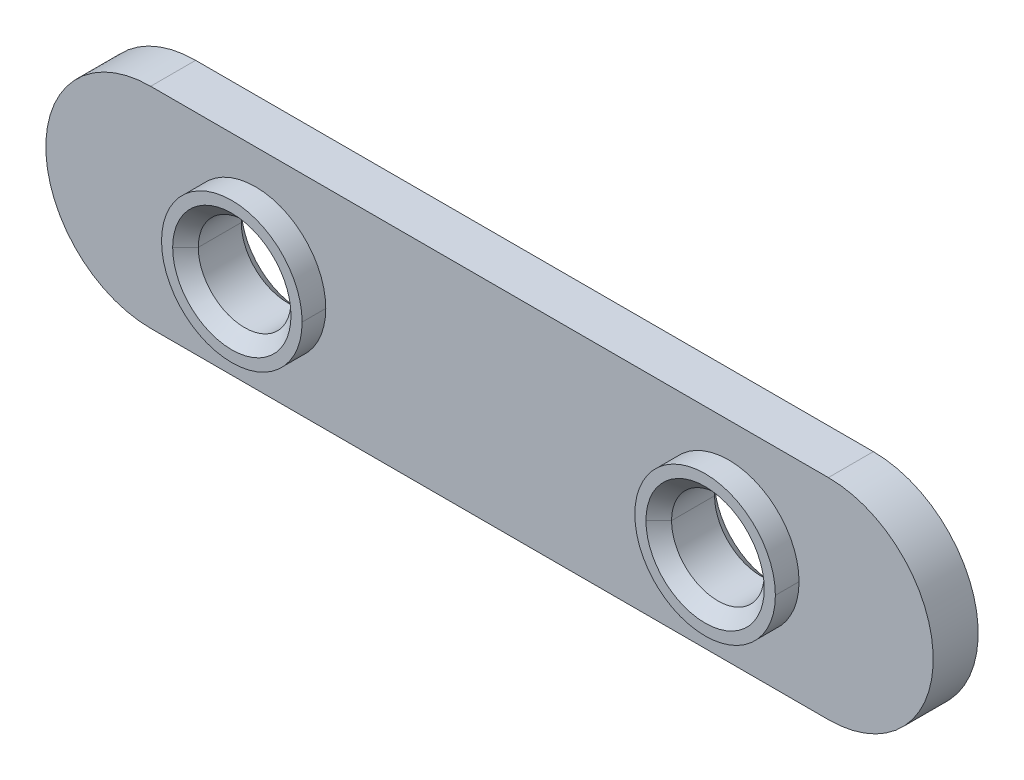
ISO-10303-21;
HEADER;
FILE_DESCRIPTION(('STEP AP214'),'2;1');
FILE_NAME('part.step','',(''),(''),'','','');
FILE_SCHEMA(('AUTOMOTIVE_DESIGN { 1 0 10303 214 1 1 1 1 }'));
ENDSEC;
DATA;
#1=APPLICATION_CONTEXT('core data for automotive mechanical design processes');
#2=APPLICATION_PROTOCOL_DEFINITION('international standard','automotive_design',2000,#1);
#3=PRODUCT_CONTEXT('',#1,'mechanical');
#4=PRODUCT('Part','Part','',(#3));
#5=PRODUCT_RELATED_PRODUCT_CATEGORY('part','',(#4));
#6=PRODUCT_DEFINITION_FORMATION('','',#4);
#7=PRODUCT_DEFINITION_CONTEXT('part definition',#1,'design');
#8=PRODUCT_DEFINITION('design','',#6,#7);
#9=PRODUCT_DEFINITION_SHAPE('','',#8);
#10=(LENGTH_UNIT() NAMED_UNIT(*) SI_UNIT(.MILLI.,.METRE.));
#11=(NAMED_UNIT(*) PLANE_ANGLE_UNIT() SI_UNIT($,.RADIAN.));
#12=(NAMED_UNIT(*) SI_UNIT($,.STERADIAN.) SOLID_ANGLE_UNIT());
#13=UNCERTAINTY_MEASURE_WITH_UNIT(LENGTH_MEASURE(1.E-05),#10,'distance_accuracy_value','');
#14=(GEOMETRIC_REPRESENTATION_CONTEXT(3) GLOBAL_UNCERTAINTY_ASSIGNED_CONTEXT((#13)) GLOBAL_UNIT_ASSIGNED_CONTEXT((#10,
#11,#12)) REPRESENTATION_CONTEXT('',''));
#15=CARTESIAN_POINT('',(0.,0.,0.));
#16=DIRECTION('',(0.,0.,1.));
#17=DIRECTION('',(1.,0.,0.));
#18=AXIS2_PLACEMENT_3D('',#15,#16,#17);
#19=CARTESIAN_POINT('',(29.1719,0.,2.4765));
#20=DIRECTION('',(0.,0.,-1.));
#21=DIRECTION('',(-1.,0.,0.));
#22=AXIS2_PLACEMENT_3D('',#19,#20,#21);
#23=PLANE('',#22);
#24=CARTESIAN_POINT('',(25.4,0.,2.4765));
#25=DIRECTION('',(0.,0.,1.));
#26=DIRECTION('',(1.,0.,0.));
#27=AXIS2_PLACEMENT_3D('',#24,#25,#26);
#28=CIRCLE('',#27,3.175);
#29=CARTESIAN_POINT('',(28.575,0.,2.4765));
#30=VERTEX_POINT('',#29);
#31=CARTESIAN_POINT('',(22.2249999999982,0.,2.47649999999825));
#32=VERTEX_POINT('',#31);
#33=EDGE_CURVE('E11',#30,#32,#28,.T.);
#34=ORIENTED_EDGE('',*,*,#33,.F.);
#35=CARTESIAN_POINT('',(25.4,0.,2.4765));
#36=DIRECTION('',(0.,0.,1.));
#37=DIRECTION('',(1.,0.,0.));
#38=AXIS2_PLACEMENT_3D('',#35,#36,#37);
#39=CIRCLE('',#38,3.175);
#40=EDGE_CURVE('E25',#32,#30,#39,.T.);
#41=ORIENTED_EDGE('',*,*,#40,.F.);
#42=EDGE_LOOP('',(#34,#41));
#43=FACE_BOUND('',#42,.T.);
#44=CARTESIAN_POINT('',(25.4,0.,2.4765));
#45=DIRECTION('',(0.,0.,1.));
#46=DIRECTION('',(1.,0.,0.));
#47=AXIS2_PLACEMENT_3D('',#44,#45,#46);
#48=CIRCLE('',#47,3.7719);
#49=CARTESIAN_POINT('',(29.1719,0.,2.4765));
#50=VERTEX_POINT('',#49);
#51=CARTESIAN_POINT('',(21.6281,0.,2.4765));
#52=VERTEX_POINT('',#51);
#53=EDGE_CURVE('E348',#50,#52,#48,.T.);
#54=ORIENTED_EDGE('',*,*,#53,.T.);
#55=CARTESIAN_POINT('',(25.4,0.,2.4765));
#56=DIRECTION('',(0.,0.,1.));
#57=DIRECTION('',(1.,0.,0.));
#58=AXIS2_PLACEMENT_3D('',#55,#56,#57);
#59=CIRCLE('',#58,3.7719);
#60=EDGE_CURVE('E344',#52,#50,#59,.T.);
#61=ORIENTED_EDGE('',*,*,#60,.T.);
#62=EDGE_LOOP('',(#54,#61));
#63=FACE_BOUND('',#62,.T.);
#64=ADVANCED_FACE('F17',(#43,#63),#23,.F.);
#65=CARTESIAN_POINT('',(25.4,0.,2.4765));
#66=DIRECTION('',(0.,0.,-1.));
#67=DIRECTION('',(0.,1.,0.));
#68=AXIS2_PLACEMENT_3D('',#65,#66,#67);
#69=CYLINDRICAL_SURFACE('',#68,3.7719);
#70=CARTESIAN_POINT('',(25.4,0.,1.2065));
#71=DIRECTION('',(0.,0.,1.));
#72=DIRECTION('',(1.,0.,0.));
#73=AXIS2_PLACEMENT_3D('',#70,#71,#72);
#74=CIRCLE('',#73,3.7719);
#75=CARTESIAN_POINT('',(21.6281,0.,1.2065));
#76=VERTEX_POINT('',#75);
#77=CARTESIAN_POINT('',(29.1719,0.,1.2065));
#78=VERTEX_POINT('',#77);
#79=EDGE_CURVE('E340',#76,#78,#74,.T.);
#80=ORIENTED_EDGE('',*,*,#79,.T.);
#81=DIRECTION('',(0.,0.,-1.));
#82=VECTOR('',#81,1.);
#83=CARTESIAN_POINT('',(29.1719,0.,2.4765));
#84=LINE('',#83,#82);
#85=EDGE_CURVE('E335',#50,#78,#84,.T.);
#86=ORIENTED_EDGE('',*,*,#85,.F.);
#87=ORIENTED_EDGE('',*,*,#60,.F.);
#88=DIRECTION('',(0.,0.,-1.));
#89=VECTOR('',#88,1.);
#90=CARTESIAN_POINT('',(21.6281,0.,2.4765));
#91=LINE('',#90,#89);
#92=EDGE_CURVE('E331',#52,#76,#91,.T.);
#93=ORIENTED_EDGE('',*,*,#92,.T.);
#94=EDGE_LOOP('',(#80,#86,#87,#93));
#95=FACE_BOUND('',#94,.T.);
#96=ADVANCED_FACE('F363',(#95),#69,.T.);
#97=CARTESIAN_POINT('',(25.4,0.,2.4765));
#98=DIRECTION('',(0.,0.,-1.));
#99=DIRECTION('',(0.,-1.,0.));
#100=AXIS2_PLACEMENT_3D('',#97,#98,#99);
#101=CYLINDRICAL_SURFACE('',#100,3.7719);
#102=ORIENTED_EDGE('',*,*,#53,.F.);
#103=ORIENTED_EDGE('',*,*,#85,.T.);
#104=CARTESIAN_POINT('',(25.4,0.,1.2065));
#105=DIRECTION('',(0.,0.,1.));
#106=DIRECTION('',(1.,0.,0.));
#107=AXIS2_PLACEMENT_3D('',#104,#105,#106);
#108=CIRCLE('',#107,3.7719);
#109=EDGE_CURVE('E326',#78,#76,#108,.T.);
#110=ORIENTED_EDGE('',*,*,#109,.T.);
#111=ORIENTED_EDGE('',*,*,#92,.F.);
#112=EDGE_LOOP('',(#102,#103,#110,#111));
#113=FACE_BOUND('',#112,.T.);
#114=ADVANCED_FACE('F364',(#113),#101,.T.);
#115=CARTESIAN_POINT('',(-5.6261,0.,1.2065));
#116=DIRECTION('',(0.,0.,1.));
#117=DIRECTION('',(1.,0.,0.));
#118=AXIS2_PLACEMENT_3D('',#115,#116,#117);
#119=PLANE('',#118);
#120=ORIENTED_EDGE('',*,*,#109,.F.);
#121=ORIENTED_EDGE('',*,*,#79,.F.);
#122=EDGE_LOOP('',(#120,#121));
#123=FACE_BOUND('',#122,.T.);
#124=CARTESIAN_POINT('',(0.,0.,1.2065));
#125=DIRECTION('',(0.,0.,1.));
#126=DIRECTION('',(1.,0.,0.));
#127=AXIS2_PLACEMENT_3D('',#124,#125,#126);
#128=CIRCLE('',#127,3.7719);
#129=CARTESIAN_POINT('',(3.7719,0.,1.2065));
#130=VERTEX_POINT('',#129);
#131=CARTESIAN_POINT('',(-3.7719,0.,1.2065));
#132=VERTEX_POINT('',#131);
#133=EDGE_CURVE('E321',#130,#132,#128,.T.);
#134=ORIENTED_EDGE('',*,*,#133,.F.);
#135=CARTESIAN_POINT('',(0.,0.,1.2065));
#136=DIRECTION('',(0.,0.,1.));
#137=DIRECTION('',(1.,0.,0.));
#138=AXIS2_PLACEMENT_3D('',#135,#136,#137);
#139=CIRCLE('',#138,3.7719);
#140=EDGE_CURVE('E316',#132,#130,#139,.T.);
#141=ORIENTED_EDGE('',*,*,#140,.F.);
#142=EDGE_LOOP('',(#134,#141));
#143=FACE_BOUND('',#142,.T.);
#144=DIRECTION('',(-1.,0.,0.));
#145=VECTOR('',#144,1.);
#146=CARTESIAN_POINT('',(30.7467,5.6261,1.2065));
#147=LINE('',#146,#145);
#148=CARTESIAN_POINT('',(30.7467,5.6261,1.2065));
#149=VERTEX_POINT('',#148);
#150=CARTESIAN_POINT('',(-5.6261,5.6261,1.2065));
#151=VERTEX_POINT('',#150);
#152=EDGE_CURVE('E312',#149,#151,#147,.T.);
#153=ORIENTED_EDGE('',*,*,#152,.T.);
#154=CARTESIAN_POINT('',(-5.6261,0.,1.2065));
#155=DIRECTION('',(0.,0.,1.));
#156=DIRECTION('',(1.,0.,0.));
#157=AXIS2_PLACEMENT_3D('',#154,#155,#156);
#158=CIRCLE('',#157,5.6261);
#159=CARTESIAN_POINT('',(-5.6261,-5.6261,1.2065));
#160=VERTEX_POINT('',#159);
#161=EDGE_CURVE('E308',#151,#160,#158,.T.);
#162=ORIENTED_EDGE('',*,*,#161,.T.);
#163=DIRECTION('',(1.,0.,0.));
#164=VECTOR('',#163,1.);
#165=CARTESIAN_POINT('',(-5.6261,-5.6261,1.2065));
#166=LINE('',#165,#164);
#167=CARTESIAN_POINT('',(30.7467,-5.6261,1.2065));
#168=VERTEX_POINT('',#167);
#169=EDGE_CURVE('E304',#160,#168,#166,.T.);
#170=ORIENTED_EDGE('',*,*,#169,.T.);
#171=CARTESIAN_POINT('',(30.7467,0.,1.2065));
#172=DIRECTION('',(0.,0.,1.));
#173=DIRECTION('',(1.,0.,0.));
#174=AXIS2_PLACEMENT_3D('',#171,#172,#173);
#175=CIRCLE('',#174,5.6261);
#176=EDGE_CURVE('E300',#168,#149,#175,.T.);
#177=ORIENTED_EDGE('',*,*,#176,.T.);
#178=EDGE_LOOP('',(#153,#162,#170,#177));
#179=FACE_BOUND('',#178,.T.);
#180=ADVANCED_FACE('F368',(#123,#143,#179),#119,.T.);
#181=CARTESIAN_POINT('',(30.7467,0.,1.2065));
#182=DIRECTION('',(0.,0.,1.));
#183=DIRECTION('',(-1.,0.,0.));
#184=AXIS2_PLACEMENT_3D('',#181,#182,#183);
#185=CYLINDRICAL_SURFACE('',#184,5.6261);
#186=CARTESIAN_POINT('',(30.7467,0.,-1.2065));
#187=DIRECTION('',(0.,0.,1.));
#188=DIRECTION('',(1.,0.,0.));
#189=AXIS2_PLACEMENT_3D('',#186,#187,#188);
#190=CIRCLE('',#189,5.6261);
#191=CARTESIAN_POINT('',(30.7467,-5.6261,-1.2065));
#192=VERTEX_POINT('',#191);
#193=CARTESIAN_POINT('',(30.7467,5.6261,-1.2065));
#194=VERTEX_POINT('',#193);
#195=EDGE_CURVE('E296',#192,#194,#190,.T.);
#196=ORIENTED_EDGE('',*,*,#195,.T.);
#197=DIRECTION('',(0.,0.,-1.));
#198=VECTOR('',#197,1.);
#199=CARTESIAN_POINT('',(30.7467,5.6261,1.2065));
#200=LINE('',#199,#198);
#201=EDGE_CURVE('E291',#149,#194,#200,.T.);
#202=ORIENTED_EDGE('',*,*,#201,.F.);
#203=ORIENTED_EDGE('',*,*,#176,.F.);
#204=DIRECTION('',(0.,0.,-1.));
#205=VECTOR('',#204,1.);
#206=CARTESIAN_POINT('',(30.7467,-5.6261,1.2065));
#207=LINE('',#206,#205);
#208=EDGE_CURVE('E287',#168,#192,#207,.T.);
#209=ORIENTED_EDGE('',*,*,#208,.T.);
#210=EDGE_LOOP('',(#196,#202,#203,#209));
#211=FACE_BOUND('',#210,.T.);
#212=ADVANCED_FACE('F371',(#211),#185,.T.);
#213=CARTESIAN_POINT('',(-5.6261,-5.6261,1.2065));
#214=DIRECTION('',(0.,1.,0.));
#215=DIRECTION('',(0.,0.,1.));
#216=AXIS2_PLACEMENT_3D('',#213,#214,#215);
#217=PLANE('',#216);
#218=DIRECTION('',(1.,0.,0.));
#219=VECTOR('',#218,1.);
#220=CARTESIAN_POINT('',(-5.6261,-5.6261,-1.2065));
#221=LINE('',#220,#219);
#222=CARTESIAN_POINT('',(-5.6261,-5.6261,-1.2065));
#223=VERTEX_POINT('',#222);
#224=EDGE_CURVE('E282',#223,#192,#221,.T.);
#225=ORIENTED_EDGE('',*,*,#224,.T.);
#226=ORIENTED_EDGE('',*,*,#208,.F.);
#227=ORIENTED_EDGE('',*,*,#169,.F.);
#228=DIRECTION('',(0.,0.,-1.));
#229=VECTOR('',#228,1.);
#230=CARTESIAN_POINT('',(-5.6261,-5.6261,1.2065));
#231=LINE('',#230,#229);
#232=EDGE_CURVE('E278',#160,#223,#231,.T.);
#233=ORIENTED_EDGE('',*,*,#232,.T.);
#234=EDGE_LOOP('',(#225,#226,#227,#233));
#235=FACE_BOUND('',#234,.T.);
#236=ADVANCED_FACE('F393',(#235),#217,.F.);
#237=CARTESIAN_POINT('',(-5.6261,0.,1.2065));
#238=DIRECTION('',(0.,0.,1.));
#239=DIRECTION('',(1.,0.,0.));
#240=AXIS2_PLACEMENT_3D('',#237,#238,#239);
#241=CYLINDRICAL_SURFACE('',#240,5.6261);
#242=CARTESIAN_POINT('',(-5.6261,0.,-1.2065));
#243=DIRECTION('',(0.,0.,1.));
#244=DIRECTION('',(1.,0.,0.));
#245=AXIS2_PLACEMENT_3D('',#242,#243,#244);
#246=CIRCLE('',#245,5.6261);
#247=CARTESIAN_POINT('',(-5.6261,5.6261,-1.2065));
#248=VERTEX_POINT('',#247);
#249=EDGE_CURVE('E273',#248,#223,#246,.T.);
#250=ORIENTED_EDGE('',*,*,#249,.T.);
#251=ORIENTED_EDGE('',*,*,#232,.F.);
#252=ORIENTED_EDGE('',*,*,#161,.F.);
#253=DIRECTION('',(0.,0.,-1.));
#254=VECTOR('',#253,1.);
#255=CARTESIAN_POINT('',(-5.6261,5.6261,1.2065));
#256=LINE('',#255,#254);
#257=EDGE_CURVE('E269',#151,#248,#256,.T.);
#258=ORIENTED_EDGE('',*,*,#257,.T.);
#259=EDGE_LOOP('',(#250,#251,#252,#258));
#260=FACE_BOUND('',#259,.T.);
#261=ADVANCED_FACE('F383',(#260),#241,.T.);
#262=CARTESIAN_POINT('',(30.7467,5.6261,1.2065));
#263=DIRECTION('',(0.,-1.,0.));
#264=DIRECTION('',(0.,0.,-1.));
#265=AXIS2_PLACEMENT_3D('',#262,#263,#264);
#266=PLANE('',#265);
#267=DIRECTION('',(-1.,0.,0.));
#268=VECTOR('',#267,1.);
#269=CARTESIAN_POINT('',(30.7467,5.6261,-1.2065));
#270=LINE('',#269,#268);
#271=EDGE_CURVE('E264',#194,#248,#270,.T.);
#272=ORIENTED_EDGE('',*,*,#271,.T.);
#273=ORIENTED_EDGE('',*,*,#257,.F.);
#274=ORIENTED_EDGE('',*,*,#152,.F.);
#275=ORIENTED_EDGE('',*,*,#201,.T.);
#276=EDGE_LOOP('',(#272,#273,#274,#275));
#277=FACE_BOUND('',#276,.T.);
#278=ADVANCED_FACE('F384',(#277),#266,.F.);
#279=CARTESIAN_POINT('',(-5.6261,0.,-1.2065));
#280=DIRECTION('',(0.,0.,1.));
#281=DIRECTION('',(1.,0.,0.));
#282=AXIS2_PLACEMENT_3D('',#279,#280,#281);
#283=PLANE('',#282);
#284=CARTESIAN_POINT('',(25.4,0.,-1.2065));
#285=DIRECTION('',(0.,0.,1.));
#286=DIRECTION('',(1.,0.,0.));
#287=AXIS2_PLACEMENT_3D('',#284,#285,#286);
#288=CIRCLE('',#287,3.175);
#289=CARTESIAN_POINT('',(28.575,0.,-1.2065));
#290=VERTEX_POINT('',#289);
#291=CARTESIAN_POINT('',(22.225,0.,-1.2065));
#292=VERTEX_POINT('',#291);
#293=EDGE_CURVE('E260',#290,#292,#288,.T.);
#294=ORIENTED_EDGE('',*,*,#293,.T.);
#295=CARTESIAN_POINT('',(25.4,0.,-1.2065));
#296=DIRECTION('',(0.,0.,1.));
#297=DIRECTION('',(1.,0.,0.));
#298=AXIS2_PLACEMENT_3D('',#295,#296,#297);
#299=CIRCLE('',#298,3.175);
#300=EDGE_CURVE('E256',#292,#290,#299,.T.);
#301=ORIENTED_EDGE('',*,*,#300,.T.);
#302=EDGE_LOOP('',(#294,#301));
#303=FACE_BOUND('',#302,.T.);
#304=CARTESIAN_POINT('',(0.,0.,-1.2065));
#305=DIRECTION('',(0.,0.,1.));
#306=DIRECTION('',(1.,0.,0.));
#307=AXIS2_PLACEMENT_3D('',#304,#305,#306);
#308=CIRCLE('',#307,3.175);
#309=CARTESIAN_POINT('',(3.175,0.,-1.2065));
#310=VERTEX_POINT('',#309);
#311=CARTESIAN_POINT('',(-3.175,0.,-1.2065));
#312=VERTEX_POINT('',#311);
#313=EDGE_CURVE('E252',#310,#312,#308,.T.);
#314=ORIENTED_EDGE('',*,*,#313,.T.);
#315=CARTESIAN_POINT('',(0.,0.,-1.2065));
#316=DIRECTION('',(0.,0.,1.));
#317=DIRECTION('',(1.,0.,0.));
#318=AXIS2_PLACEMENT_3D('',#315,#316,#317);
#319=CIRCLE('',#318,3.175);
#320=EDGE_CURVE('E248',#312,#310,#319,.T.);
#321=ORIENTED_EDGE('',*,*,#320,.T.);
#322=EDGE_LOOP('',(#314,#321));
#323=FACE_BOUND('',#322,.T.);
#324=ORIENTED_EDGE('',*,*,#271,.F.);
#325=ORIENTED_EDGE('',*,*,#195,.F.);
#326=ORIENTED_EDGE('',*,*,#224,.F.);
#327=ORIENTED_EDGE('',*,*,#249,.F.);
#328=EDGE_LOOP('',(#324,#325,#326,#327));
#329=FACE_BOUND('',#328,.T.);
#330=ADVANCED_FACE('F390',(#303,#323,#329),#283,.F.);
#331=CARTESIAN_POINT('',(0.,0.,-1.2065));
#332=DIRECTION('',(0.,0.,-1.));
#333=DIRECTION('',(0.,1.,0.));
#334=AXIS2_PLACEMENT_3D('',#331,#332,#333);
#335=CONICAL_SURFACE('',#334,3.175,0.7853981634);
#336=ORIENTED_EDGE('',*,*,#320,.F.);
#337=DIRECTION('',(-0.707106781188352,0.,-0.707106781184743));
#338=VECTOR('',#337,1.);
#339=CARTESIAN_POINT('',(-2.48792999999825,0.,-0.519430000001753));
#340=LINE('',#339,#338);
#341=CARTESIAN_POINT('',(-2.48792999999825,0.,-0.519430000001753));
#342=VERTEX_POINT('',#341);
#343=EDGE_CURVE('E243',#342,#312,#340,.T.);
#344=ORIENTED_EDGE('',*,*,#343,.F.);
#345=CARTESIAN_POINT('',(0.,0.,-0.51943));
#346=DIRECTION('',(0.,0.,1.));
#347=DIRECTION('',(1.,0.,0.));
#348=AXIS2_PLACEMENT_3D('',#345,#346,#347);
#349=CIRCLE('',#348,2.48793);
#350=CARTESIAN_POINT('',(2.48793,0.,-0.51943));
#351=VERTEX_POINT('',#350);
#352=EDGE_CURVE('E239',#342,#351,#349,.T.);
#353=ORIENTED_EDGE('',*,*,#352,.T.);
#354=DIRECTION('',(0.707106781188352,0.,-0.707106781184743));
#355=VECTOR('',#354,1.);
#356=CARTESIAN_POINT('',(2.48792999999825,0.,-0.519430000001753));
#357=LINE('',#356,#355);
#358=EDGE_CURVE('E234',#351,#310,#357,.T.);
#359=ORIENTED_EDGE('',*,*,#358,.T.);
#360=EDGE_LOOP('',(#336,#344,#353,#359));
#361=FACE_BOUND('',#360,.T.);
#362=ADVANCED_FACE('F455',(#361),#335,.F.);
#363=CARTESIAN_POINT('',(0.,0.,-1.2065));
#364=DIRECTION('',(0.,0.,-1.));
#365=DIRECTION('',(0.,-1.,0.));
#366=AXIS2_PLACEMENT_3D('',#363,#364,#365);
#367=CONICAL_SURFACE('',#366,3.175,0.7853981634);
#368=CARTESIAN_POINT('',(0.,0.,-0.51943));
#369=DIRECTION('',(0.,0.,1.));
#370=DIRECTION('',(1.,0.,0.));
#371=AXIS2_PLACEMENT_3D('',#368,#369,#370);
#372=CIRCLE('',#371,2.48793);
#373=EDGE_CURVE('E229',#351,#342,#372,.T.);
#374=ORIENTED_EDGE('',*,*,#373,.T.);
#375=ORIENTED_EDGE('',*,*,#343,.T.);
#376=ORIENTED_EDGE('',*,*,#313,.F.);
#377=ORIENTED_EDGE('',*,*,#358,.F.);
#378=EDGE_LOOP('',(#374,#375,#376,#377));
#379=FACE_BOUND('',#378,.T.);
#380=ADVANCED_FACE('F465',(#379),#367,.F.);
#381=CARTESIAN_POINT('',(0.,0.,2.4765));
#382=DIRECTION('',(0.,0.,-1.));
#383=DIRECTION('',(0.,-1.,0.));
#384=AXIS2_PLACEMENT_3D('',#381,#382,#383);
#385=CYLINDRICAL_SURFACE('',#384,2.48793);
#386=CARTESIAN_POINT('',(0.,0.,1.78943));
#387=DIRECTION('',(0.,0.,1.));
#388=DIRECTION('',(1.,0.,0.));
#389=AXIS2_PLACEMENT_3D('',#386,#387,#388);
#390=CIRCLE('',#389,2.48793);
#391=CARTESIAN_POINT('',(2.48793,0.,1.78943));
#392=VERTEX_POINT('',#391);
#393=CARTESIAN_POINT('',(-2.48793,0.,1.78943));
#394=VERTEX_POINT('',#393);
#395=EDGE_CURVE('E225',#392,#394,#390,.T.);
#396=ORIENTED_EDGE('',*,*,#395,.T.);
#397=DIRECTION('',(0.,0.,-1.));
#398=VECTOR('',#397,1.);
#399=CARTESIAN_POINT('',(-2.48793,0.,1.78943));
#400=LINE('',#399,#398);
#401=EDGE_CURVE('E220',#394,#342,#400,.T.);
#402=ORIENTED_EDGE('',*,*,#401,.T.);
#403=ORIENTED_EDGE('',*,*,#373,.F.);
#404=DIRECTION('',(0.,0.,-1.));
#405=VECTOR('',#404,1.);
#406=CARTESIAN_POINT('',(2.48793,0.,1.78943));
#407=LINE('',#406,#405);
#408=EDGE_CURVE('E215',#392,#351,#407,.T.);
#409=ORIENTED_EDGE('',*,*,#408,.F.);
#410=EDGE_LOOP('',(#396,#402,#403,#409));
#411=FACE_BOUND('',#410,.T.);
#412=ADVANCED_FACE('F475',(#411),#385,.F.);
#413=CARTESIAN_POINT('',(0.,0.,2.4765));
#414=DIRECTION('',(0.,0.,-1.));
#415=DIRECTION('',(0.,1.,0.));
#416=AXIS2_PLACEMENT_3D('',#413,#414,#415);
#417=CYLINDRICAL_SURFACE('',#416,2.48793);
#418=ORIENTED_EDGE('',*,*,#352,.F.);
#419=ORIENTED_EDGE('',*,*,#401,.F.);
#420=CARTESIAN_POINT('',(0.,0.,1.78943));
#421=DIRECTION('',(0.,0.,1.));
#422=DIRECTION('',(1.,0.,0.));
#423=AXIS2_PLACEMENT_3D('',#420,#421,#422);
#424=CIRCLE('',#423,2.48793);
#425=EDGE_CURVE('E210',#394,#392,#424,.T.);
#426=ORIENTED_EDGE('',*,*,#425,.T.);
#427=ORIENTED_EDGE('',*,*,#408,.T.);
#428=EDGE_LOOP('',(#418,#419,#426,#427));
#429=FACE_BOUND('',#428,.T.);
#430=ADVANCED_FACE('F485',(#429),#417,.F.);
#431=CARTESIAN_POINT('',(0.,0.,1.78943));
#432=DIRECTION('',(0.,0.,1.));
#433=DIRECTION('',(0.,1.,0.));
#434=AXIS2_PLACEMENT_3D('',#431,#432,#433);
#435=CONICAL_SURFACE('',#434,2.48793,0.7853981634);
#436=ORIENTED_EDGE('',*,*,#425,.F.);
#437=DIRECTION('',(-0.707106781188352,0.,0.707106781184744));
#438=VECTOR('',#437,1.);
#439=CARTESIAN_POINT('',(-2.48793,0.,1.78943));
#440=LINE('',#439,#438);
#441=CARTESIAN_POINT('',(-3.17500000000175,0.,2.47649999999825));
#442=VERTEX_POINT('',#441);
#443=EDGE_CURVE('E206',#394,#442,#440,.T.);
#444=ORIENTED_EDGE('',*,*,#443,.T.);
#445=CARTESIAN_POINT('',(0.,0.,2.4765));
#446=DIRECTION('',(0.,0.,1.));
#447=DIRECTION('',(1.,0.,0.));
#448=AXIS2_PLACEMENT_3D('',#445,#446,#447);
#449=CIRCLE('',#448,3.175);
#450=CARTESIAN_POINT('',(3.175,0.,2.4765));
#451=VERTEX_POINT('',#450);
#452=EDGE_CURVE('E202',#442,#451,#449,.T.);
#453=ORIENTED_EDGE('',*,*,#452,.T.);
#454=DIRECTION('',(0.707106781188352,0.,0.707106781184744));
#455=VECTOR('',#454,1.);
#456=CARTESIAN_POINT('',(2.48793,0.,1.78943));
#457=LINE('',#456,#455);
#458=EDGE_CURVE('E197',#392,#451,#457,.T.);
#459=ORIENTED_EDGE('',*,*,#458,.F.);
#460=EDGE_LOOP('',(#436,#444,#453,#459));
#461=FACE_BOUND('',#460,.T.);
#462=ADVANCED_FACE('F495',(#461),#435,.F.);
#463=CARTESIAN_POINT('',(0.,0.,1.78943));
#464=DIRECTION('',(0.,0.,1.));
#465=DIRECTION('',(0.,-1.,0.));
#466=AXIS2_PLACEMENT_3D('',#463,#464,#465);
#467=CONICAL_SURFACE('',#466,2.48793,0.7853981634);
#468=CARTESIAN_POINT('',(0.,0.,2.4765));
#469=DIRECTION('',(0.,0.,1.));
#470=DIRECTION('',(1.,0.,0.));
#471=AXIS2_PLACEMENT_3D('',#468,#469,#470);
#472=CIRCLE('',#471,3.175);
#473=EDGE_CURVE('E192',#451,#442,#472,.T.);
#474=ORIENTED_EDGE('',*,*,#473,.T.);
#475=ORIENTED_EDGE('',*,*,#443,.F.);
#476=ORIENTED_EDGE('',*,*,#395,.F.);
#477=ORIENTED_EDGE('',*,*,#458,.T.);
#478=EDGE_LOOP('',(#474,#475,#476,#477));
#479=FACE_BOUND('',#478,.T.);
#480=ADVANCED_FACE('F505',(#479),#467,.F.);
#481=CARTESIAN_POINT('',(3.7719,0.,2.4765));
#482=DIRECTION('',(0.,0.,-1.));
#483=DIRECTION('',(-1.,0.,0.));
#484=AXIS2_PLACEMENT_3D('',#481,#482,#483);
#485=PLANE('',#484);
#486=ORIENTED_EDGE('',*,*,#473,.F.);
#487=ORIENTED_EDGE('',*,*,#452,.F.);
#488=EDGE_LOOP('',(#486,#487));
#489=FACE_BOUND('',#488,.T.);
#490=CARTESIAN_POINT('',(0.,0.,2.4765));
#491=DIRECTION('',(0.,0.,1.));
#492=DIRECTION('',(1.,0.,0.));
#493=AXIS2_PLACEMENT_3D('',#490,#491,#492);
#494=CIRCLE('',#493,3.7719);
#495=CARTESIAN_POINT('',(3.7719,0.,2.4765));
#496=VERTEX_POINT('',#495);
#497=CARTESIAN_POINT('',(-3.7719,0.,2.4765));
#498=VERTEX_POINT('',#497);
#499=EDGE_CURVE('E188',#496,#498,#494,.T.);
#500=ORIENTED_EDGE('',*,*,#499,.T.);
#501=CARTESIAN_POINT('',(0.,0.,2.4765));
#502=DIRECTION('',(0.,0.,1.));
#503=DIRECTION('',(1.,0.,0.));
#504=AXIS2_PLACEMENT_3D('',#501,#502,#503);
#505=CIRCLE('',#504,3.7719);
#506=EDGE_CURVE('E184',#498,#496,#505,.T.);
#507=ORIENTED_EDGE('',*,*,#506,.T.);
#508=EDGE_LOOP('',(#500,#507));
#509=FACE_BOUND('',#508,.T.);
#510=ADVANCED_FACE('F515',(#489,#509),#485,.F.);
#511=CARTESIAN_POINT('',(0.,0.,2.4765));
#512=DIRECTION('',(0.,0.,-1.));
#513=DIRECTION('',(0.,1.,0.));
#514=AXIS2_PLACEMENT_3D('',#511,#512,#513);
#515=CYLINDRICAL_SURFACE('',#514,3.7719);
#516=ORIENTED_EDGE('',*,*,#140,.T.);
#517=DIRECTION('',(0.,0.,-1.));
#518=VECTOR('',#517,1.);
#519=CARTESIAN_POINT('',(3.7719,0.,2.4765));
#520=LINE('',#519,#518);
#521=EDGE_CURVE('E179',#496,#130,#520,.T.);
#522=ORIENTED_EDGE('',*,*,#521,.F.);
#523=ORIENTED_EDGE('',*,*,#506,.F.);
#524=DIRECTION('',(0.,0.,-1.));
#525=VECTOR('',#524,1.);
#526=CARTESIAN_POINT('',(-3.7719,0.,2.4765));
#527=LINE('',#526,#525);
#528=EDGE_CURVE('E174',#498,#132,#527,.T.);
#529=ORIENTED_EDGE('',*,*,#528,.T.);
#530=EDGE_LOOP('',(#516,#522,#523,#529));
#531=FACE_BOUND('',#530,.T.);
#532=ADVANCED_FACE('F525',(#531),#515,.T.);
#533=CARTESIAN_POINT('',(0.,0.,2.4765));
#534=DIRECTION('',(0.,0.,-1.));
#535=DIRECTION('',(0.,-1.,0.));
#536=AXIS2_PLACEMENT_3D('',#533,#534,#535);
#537=CYLINDRICAL_SURFACE('',#536,3.7719);
#538=ORIENTED_EDGE('',*,*,#499,.F.);
#539=ORIENTED_EDGE('',*,*,#521,.T.);
#540=ORIENTED_EDGE('',*,*,#133,.T.);
#541=ORIENTED_EDGE('',*,*,#528,.F.);
#542=EDGE_LOOP('',(#538,#539,#540,#541));
#543=FACE_BOUND('',#542,.T.);
#544=ADVANCED_FACE('F535',(#543),#537,.T.);
#545=CARTESIAN_POINT('',(25.4,0.,-1.2065));
#546=DIRECTION('',(0.,0.,-1.));
#547=DIRECTION('',(0.,1.,0.));
#548=AXIS2_PLACEMENT_3D('',#545,#546,#547);
#549=CONICAL_SURFACE('',#548,3.175,0.7853981634);
#550=ORIENTED_EDGE('',*,*,#300,.F.);
#551=DIRECTION('',(-0.707106781188351,0.,-0.707106781184744));
#552=VECTOR('',#551,1.);
#553=CARTESIAN_POINT('',(22.9120700000018,0.,-0.519430000001752));
#554=LINE('',#553,#552);
#555=CARTESIAN_POINT('',(22.9120700000018,0.,-0.519430000001752));
#556=VERTEX_POINT('',#555);
#557=EDGE_CURVE('E169',#556,#292,#554,.T.);
#558=ORIENTED_EDGE('',*,*,#557,.F.);
#559=CARTESIAN_POINT('',(25.4,0.,-0.51943));
#560=DIRECTION('',(0.,0.,1.));
#561=DIRECTION('',(1.,0.,0.));
#562=AXIS2_PLACEMENT_3D('',#559,#560,#561);
#563=CIRCLE('',#562,2.48793);
#564=CARTESIAN_POINT('',(27.88793,0.,-0.51943));
#565=VERTEX_POINT('',#564);
#566=EDGE_CURVE('E165',#556,#565,#563,.T.);
#567=ORIENTED_EDGE('',*,*,#566,.T.);
#568=DIRECTION('',(0.707106781188351,0.,-0.707106781184744));
#569=VECTOR('',#568,1.);
#570=CARTESIAN_POINT('',(27.8879299999982,0.,-0.519430000001752));
#571=LINE('',#570,#569);
#572=EDGE_CURVE('E153',#565,#290,#571,.T.);
#573=ORIENTED_EDGE('',*,*,#572,.T.);
#574=EDGE_LOOP('',(#550,#558,#567,#573));
#575=FACE_BOUND('',#574,.T.);
#576=ADVANCED_FACE('F545',(#575),#549,.F.);
#577=CARTESIAN_POINT('',(25.4,0.,-1.2065));
#578=DIRECTION('',(0.,0.,-1.));
#579=DIRECTION('',(0.,-1.,0.));
#580=AXIS2_PLACEMENT_3D('',#577,#578,#579);
#581=CONICAL_SURFACE('',#580,3.175,0.7853981634);
#582=CARTESIAN_POINT('',(25.4,0.,-0.51943));
#583=DIRECTION('',(0.,0.,1.));
#584=DIRECTION('',(1.,0.,0.));
#585=AXIS2_PLACEMENT_3D('',#582,#583,#584);
#586=CIRCLE('',#585,2.48793);
#587=EDGE_CURVE('E133',#565,#556,#586,.T.);
#588=ORIENTED_EDGE('',*,*,#587,.T.);
#589=ORIENTED_EDGE('',*,*,#557,.T.);
#590=ORIENTED_EDGE('',*,*,#293,.F.);
#591=ORIENTED_EDGE('',*,*,#572,.F.);
#592=EDGE_LOOP('',(#588,#589,#590,#591));
#593=FACE_BOUND('',#592,.T.);
#594=ADVANCED_FACE('F555',(#593),#581,.F.);
#595=CARTESIAN_POINT('',(25.4,0.,2.4765));
#596=DIRECTION('',(0.,0.,-1.));
#597=DIRECTION('',(0.,-1.,0.));
#598=AXIS2_PLACEMENT_3D('',#595,#596,#597);
#599=CYLINDRICAL_SURFACE('',#598,2.48793);
#600=CARTESIAN_POINT('',(25.4,0.,1.78943));
#601=DIRECTION('',(0.,0.,1.));
#602=DIRECTION('',(1.,0.,0.));
#603=AXIS2_PLACEMENT_3D('',#600,#601,#602);
#604=CIRCLE('',#603,2.48793);
#605=CARTESIAN_POINT('',(27.88793,0.,1.78943));
#606=VERTEX_POINT('',#605);
#607=CARTESIAN_POINT('',(22.91207,0.,1.78943));
#608=VERTEX_POINT('',#607);
#609=EDGE_CURVE('E130',#606,#608,#604,.T.);
#610=ORIENTED_EDGE('',*,*,#609,.T.);
#611=DIRECTION('',(0.,0.,-1.));
#612=VECTOR('',#611,1.);
#613=CARTESIAN_POINT('',(22.91207,0.,1.78943));
#614=LINE('',#613,#612);
#615=EDGE_CURVE('E136',#608,#556,#614,.T.);
#616=ORIENTED_EDGE('',*,*,#615,.T.);
#617=ORIENTED_EDGE('',*,*,#587,.F.);
#618=DIRECTION('',(0.,0.,-1.));
#619=VECTOR('',#618,1.);
#620=CARTESIAN_POINT('',(27.88793,0.,1.78943));
#621=LINE('',#620,#619);
#622=EDGE_CURVE('E125',#606,#565,#621,.T.);
#623=ORIENTED_EDGE('',*,*,#622,.F.);
#624=EDGE_LOOP('',(#610,#616,#617,#623));
#625=FACE_BOUND('',#624,.T.);
#626=ADVANCED_FACE('F127',(#625),#599,.F.);
#627=CARTESIAN_POINT('',(25.4,0.,2.4765));
#628=DIRECTION('',(0.,0.,-1.));
#629=DIRECTION('',(0.,1.,0.));
#630=AXIS2_PLACEMENT_3D('',#627,#628,#629);
#631=CYLINDRICAL_SURFACE('',#630,2.48793);
#632=ORIENTED_EDGE('',*,*,#566,.F.);
#633=ORIENTED_EDGE('',*,*,#615,.F.);
#634=CARTESIAN_POINT('',(25.4,0.,1.78943));
#635=DIRECTION('',(0.,0.,1.));
#636=DIRECTION('',(1.,0.,0.));
#637=AXIS2_PLACEMENT_3D('',#634,#635,#636);
#638=CIRCLE('',#637,2.48793);
#639=EDGE_CURVE('E137',#608,#606,#638,.T.);
#640=ORIENTED_EDGE('',*,*,#639,.T.);
#641=ORIENTED_EDGE('',*,*,#622,.T.);
#642=EDGE_LOOP('',(#632,#633,#640,#641));
#643=FACE_BOUND('',#642,.T.);
#644=ADVANCED_FACE('F141',(#643),#631,.F.);
#645=CARTESIAN_POINT('',(25.4,0.,1.78943));
#646=DIRECTION('',(0.,0.,1.));
#647=DIRECTION('',(0.,1.,0.));
#648=AXIS2_PLACEMENT_3D('',#645,#646,#647);
#649=CONICAL_SURFACE('',#648,2.48793,0.7853981634);
#650=ORIENTED_EDGE('',*,*,#639,.F.);
#651=DIRECTION('',(-0.707106781188351,0.,0.707106781184744));
#652=VECTOR('',#651,1.);
#653=CARTESIAN_POINT('',(22.91207,0.,1.78943));
#654=LINE('',#653,#652);
#655=EDGE_CURVE('E144',#608,#32,#654,.T.);
#656=ORIENTED_EDGE('',*,*,#655,.T.);
#657=ORIENTED_EDGE('',*,*,#40,.T.);
#658=DIRECTION('',(0.707106781188351,0.,0.707106781184744));
#659=VECTOR('',#658,1.);
#660=CARTESIAN_POINT('',(27.88793,0.,1.78943));
#661=LINE('',#660,#659);
#662=EDGE_CURVE('E147',#606,#30,#661,.T.);
#663=ORIENTED_EDGE('',*,*,#662,.F.);
#664=EDGE_LOOP('',(#650,#656,#657,#663));
#665=FACE_BOUND('',#664,.T.);
#666=ADVANCED_FACE('F148',(#665),#649,.F.);
#667=CARTESIAN_POINT('',(25.4,0.,1.78943));
#668=DIRECTION('',(0.,0.,1.));
#669=DIRECTION('',(0.,-1.,0.));
#670=AXIS2_PLACEMENT_3D('',#667,#668,#669);
#671=CONICAL_SURFACE('',#670,2.48793,0.7853981634);
#672=ORIENTED_EDGE('',*,*,#33,.T.);
#673=ORIENTED_EDGE('',*,*,#655,.F.);
#674=ORIENTED_EDGE('',*,*,#609,.F.);
#675=ORIENTED_EDGE('',*,*,#662,.T.);
#676=EDGE_LOOP('',(#672,#673,#674,#675));
#677=FACE_BOUND('',#676,.T.);
#678=ADVANCED_FACE('F151',(#677),#671,.F.);
#679=CLOSED_SHELL('',(#64,#96,#114,#180,#212,#236,#261,#278,#330,#362,#380,#412,#430,#462,#480,
#510,#532,#544,#576,#594,#626,#644,#666,#678));
#680=MANIFOLD_SOLID_BREP('B1',#679);
#681=ADVANCED_BREP_SHAPE_REPRESENTATION('',(#18,#680),#14);
#682=SHAPE_DEFINITION_REPRESENTATION(#9,#681);
ENDSEC;
END-ISO-10303-21;
